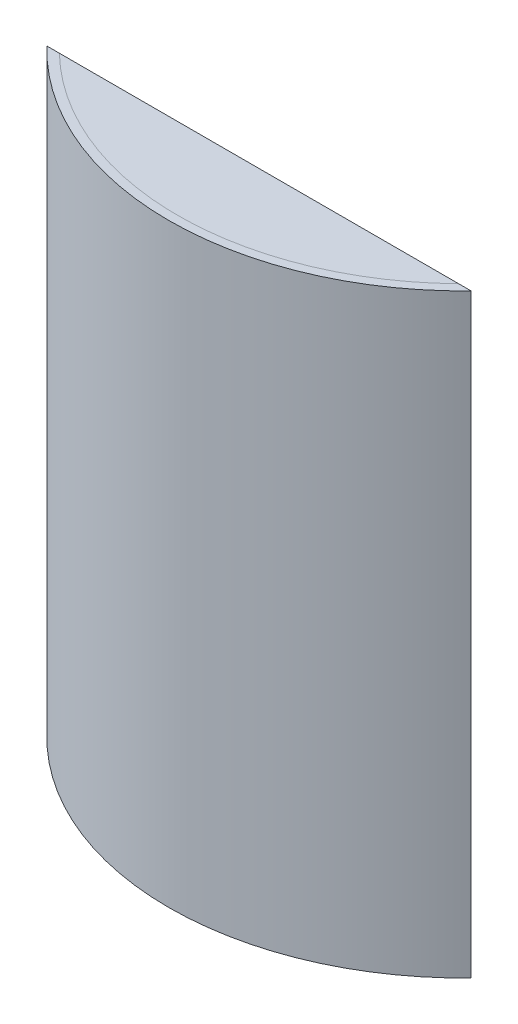
ISO-10303-21;
HEADER;
FILE_DESCRIPTION(('STEP AP214'),'2;1');
FILE_NAME('part.step','',(''),(''),'','','');
FILE_SCHEMA(('AUTOMOTIVE_DESIGN { 1 0 10303 214 1 1 1 1 }'));
ENDSEC;
DATA;
#1=APPLICATION_CONTEXT('core data for automotive mechanical design processes');
#2=APPLICATION_PROTOCOL_DEFINITION('international standard','automotive_design',2000,#1);
#3=PRODUCT_CONTEXT('',#1,'mechanical');
#4=PRODUCT('Part','Part','',(#3));
#5=PRODUCT_RELATED_PRODUCT_CATEGORY('part','',(#4));
#6=PRODUCT_DEFINITION_FORMATION('','',#4);
#7=PRODUCT_DEFINITION_CONTEXT('part definition',#1,'design');
#8=PRODUCT_DEFINITION('design','',#6,#7);
#9=PRODUCT_DEFINITION_SHAPE('','',#8);
#10=(LENGTH_UNIT() NAMED_UNIT(*) SI_UNIT(.MILLI.,.METRE.));
#11=(NAMED_UNIT(*) PLANE_ANGLE_UNIT() SI_UNIT($,.RADIAN.));
#12=(NAMED_UNIT(*) SI_UNIT($,.STERADIAN.) SOLID_ANGLE_UNIT());
#13=UNCERTAINTY_MEASURE_WITH_UNIT(LENGTH_MEASURE(1.E-05),#10,'distance_accuracy_value','');
#14=(GEOMETRIC_REPRESENTATION_CONTEXT(3) GLOBAL_UNCERTAINTY_ASSIGNED_CONTEXT((#13)) GLOBAL_UNIT_ASSIGNED_CONTEXT((#10,
#11,#12)) REPRESENTATION_CONTEXT('',''));
#15=CARTESIAN_POINT('',(0.,0.,0.));
#16=DIRECTION('',(0.,0.,1.));
#17=DIRECTION('',(1.,0.,0.));
#18=AXIS2_PLACEMENT_3D('',#15,#16,#17);
#19=CARTESIAN_POINT('',(0.,200.,0.));
#20=DIRECTION('',(0.,1.,0.));
#21=DIRECTION('',(0.,0.,1.));
#22=AXIS2_PLACEMENT_3D('',#19,#20,#21);
#23=CYLINDRICAL_SURFACE('',#22,97.);
#24=CARTESIAN_POINT('',(0.,202.,0.));
#25=DIRECTION('',(0.,1.,0.));
#26=DIRECTION('',(0.,0.,1.));
#27=AXIS2_PLACEMENT_3D('',#24,#25,#26);
#28=CIRCLE('',#27,97.);
#29=CARTESIAN_POINT('',(67.7716754994297,202.,69.3974062915899));
#30=VERTEX_POINT('',#29);
#31=CARTESIAN_POINT('',(-67.7716754994297,202.,69.3974062915899));
#32=VERTEX_POINT('',#31);
#33=EDGE_CURVE('E82',#30,#32,#28,.F.);
#34=ORIENTED_EDGE('',*,*,#33,.T.);
#35=DIRECTION('',(0.,1.,0.));
#36=VECTOR('',#35,1.);
#37=CARTESIAN_POINT('',(-67.7716754994297,200.,69.3974062915899));
#38=LINE('',#37,#36);
#39=CARTESIAN_POINT('',(-67.7716754994297,200.,69.3974062915899));
#40=VERTEX_POINT('',#39);
#41=EDGE_CURVE('E12',#40,#32,#38,.T.);
#42=ORIENTED_EDGE('',*,*,#41,.F.);
#43=CARTESIAN_POINT('',(0.,200.,0.));
#44=DIRECTION('',(0.,1.,0.));
#45=DIRECTION('',(0.,0.,1.));
#46=AXIS2_PLACEMENT_3D('',#43,#44,#45);
#47=CIRCLE('',#46,97.);
#48=CARTESIAN_POINT('',(67.7716754994297,200.,69.3974062915899));
#49=VERTEX_POINT('',#48);
#50=EDGE_CURVE('E66',#49,#40,#47,.F.);
#51=ORIENTED_EDGE('',*,*,#50,.F.);
#52=DIRECTION('',(0.,1.,0.));
#53=VECTOR('',#52,1.);
#54=CARTESIAN_POINT('',(67.7716754994297,200.,69.3974062915899));
#55=LINE('',#54,#53);
#56=EDGE_CURVE('E54',#49,#30,#55,.T.);
#57=ORIENTED_EDGE('',*,*,#56,.T.);
#58=EDGE_LOOP('',(#34,#42,#51,#57));
#59=FACE_BOUND('',#58,.T.);
#60=ADVANCED_FACE('F51',(#59),#23,.T.);
#61=CARTESIAN_POINT('',(0.,200.,69.3974062915899));
#62=DIRECTION('',(0.,0.,-1.));
#63=DIRECTION('',(-1.,0.,0.));
#64=AXIS2_PLACEMENT_3D('',#61,#62,#63);
#65=PLANE('',#64);
#66=DIRECTION('',(-1.,0.,0.));
#67=VECTOR('',#66,1.);
#68=CARTESIAN_POINT('',(0.,202.,69.3974062915899));
#69=LINE('',#68,#67);
#70=EDGE_CURVE('E80',#30,#32,#69,.T.);
#71=ORIENTED_EDGE('',*,*,#70,.F.);
#72=ORIENTED_EDGE('',*,*,#56,.F.);
#73=DIRECTION('',(-1.,0.,0.));
#74=VECTOR('',#73,1.);
#75=CARTESIAN_POINT('',(0.,200.,69.3974062915899));
#76=LINE('',#75,#74);
#77=EDGE_CURVE('E81',#49,#40,#76,.T.);
#78=ORIENTED_EDGE('',*,*,#77,.T.);
#79=ORIENTED_EDGE('',*,*,#41,.T.);
#80=EDGE_LOOP('',(#71,#72,#78,#79));
#81=FACE_BOUND('',#80,.T.);
#82=ADVANCED_FACE('F78',(#81),#65,.T.);
#83=CARTESIAN_POINT('',(0.,200.,0.));
#84=DIRECTION('',(0.,1.,0.));
#85=DIRECTION('',(0.,0.,1.));
#86=AXIS2_PLACEMENT_3D('',#83,#84,#85);
#87=PLANE('',#86);
#88=ORIENTED_EDGE('',*,*,#50,.T.);
#89=ORIENTED_EDGE('',*,*,#77,.F.);
#90=EDGE_LOOP('',(#88,#89));
#91=FACE_BOUND('',#90,.T.);
#92=ADVANCED_FACE('F90',(#91),#87,.F.);
#93=CARTESIAN_POINT('',(0.,202.,0.));
#94=DIRECTION('',(0.,1.,0.));
#95=DIRECTION('',(0.,0.,1.));
#96=AXIS2_PLACEMENT_3D('',#93,#94,#95);
#97=PLANE('',#96);
#98=ORIENTED_EDGE('',*,*,#33,.F.);
#99=ORIENTED_EDGE('',*,*,#70,.T.);
#100=EDGE_LOOP('',(#98,#99));
#101=FACE_BOUND('',#100,.T.);
#102=ADVANCED_FACE('F85',(#101),#97,.T.);
#103=CLOSED_SHELL('',(#60,#82,#92,#102));
#104=MANIFOLD_SOLID_BREP('B2',#103);
#105=CARTESIAN_POINT('',(0.,202.,0.));
#106=DIRECTION('',(0.,-1.,0.));
#107=DIRECTION('',(0.,0.,-1.));
#108=AXIS2_PLACEMENT_3D('',#105,#106,#107);
#109=CYLINDRICAL_SURFACE('',#108,97.);
#110=CARTESIAN_POINT('',(0.,2.,0.));
#111=DIRECTION('',(0.,1.,0.));
#112=DIRECTION('',(0.,0.,1.));
#113=AXIS2_PLACEMENT_3D('',#110,#111,#112);
#114=CIRCLE('',#113,97.);
#115=CARTESIAN_POINT('',(-67.7716754994297,2.,69.3974062915899));
#116=VERTEX_POINT('',#115);
#117=CARTESIAN_POINT('',(67.7716754994297,2.,69.3974062915899));
#118=VERTEX_POINT('',#117);
#119=EDGE_CURVE('E162',#116,#118,#114,.T.);
#120=ORIENTED_EDGE('',*,*,#119,.F.);
#121=DIRECTION('',(0.,-1.,0.));
#122=VECTOR('',#121,1.);
#123=CARTESIAN_POINT('',(-67.7716754994297,202.,69.3974062915899));
#124=LINE('',#123,#122);
#125=CARTESIAN_POINT('',(-67.7716754994297,202.,69.3974062915899));
#126=VERTEX_POINT('',#125);
#127=EDGE_CURVE('E49',#126,#116,#124,.T.);
#128=ORIENTED_EDGE('',*,*,#127,.F.);
#129=CARTESIAN_POINT('',(0.,202.,0.));
#130=DIRECTION('',(0.,1.,0.));
#131=DIRECTION('',(0.,0.,1.));
#132=AXIS2_PLACEMENT_3D('',#129,#130,#131);
#133=CIRCLE('',#132,97.);
#134=CARTESIAN_POINT('',(67.7716754994297,202.,69.3974062915899));
#135=VERTEX_POINT('',#134);
#136=EDGE_CURVE('E185',#126,#135,#133,.T.);
#137=ORIENTED_EDGE('',*,*,#136,.T.);
#138=DIRECTION('',(0.,-1.,0.));
#139=VECTOR('',#138,1.);
#140=CARTESIAN_POINT('',(67.7716754994297,202.,69.3974062915899));
#141=LINE('',#140,#139);
#142=EDGE_CURVE('E140',#135,#118,#141,.T.);
#143=ORIENTED_EDGE('',*,*,#142,.T.);
#144=EDGE_LOOP('',(#120,#128,#137,#143));
#145=FACE_BOUND('',#144,.T.);
#146=ADVANCED_FACE('F123',(#145),#109,.F.);
#147=CARTESIAN_POINT('',(0.,202.,0.));
#148=DIRECTION('',(0.,-1.,0.));
#149=DIRECTION('',(0.,0.,-1.));
#150=AXIS2_PLACEMENT_3D('',#147,#148,#149);
#151=CYLINDRICAL_SURFACE('',#150,100.);
#152=DIRECTION('',(0.,-1.,0.));
#153=VECTOR('',#152,1.);
#154=CARTESIAN_POINT('',(-72.,202.,69.3974062915899));
#155=LINE('',#154,#153);
#156=CARTESIAN_POINT('',(-72.,202.,69.3974062915899));
#157=VERTEX_POINT('',#156);
#158=CARTESIAN_POINT('',(-72.,0.,69.3974062915899));
#159=VERTEX_POINT('',#158);
#160=EDGE_CURVE('E132',#157,#159,#155,.T.);
#161=ORIENTED_EDGE('',*,*,#160,.T.);
#162=CARTESIAN_POINT('',(0.,0.,0.));
#163=DIRECTION('',(0.,1.,0.));
#164=DIRECTION('',(0.,0.,1.));
#165=AXIS2_PLACEMENT_3D('',#162,#163,#164);
#166=CIRCLE('',#165,100.);
#167=CARTESIAN_POINT('',(72.,0.,69.3974062915899));
#168=VERTEX_POINT('',#167);
#169=EDGE_CURVE('E197',#159,#168,#166,.T.);
#170=ORIENTED_EDGE('',*,*,#169,.T.);
#171=DIRECTION('',(0.,-1.,0.));
#172=VECTOR('',#171,1.);
#173=CARTESIAN_POINT('',(72.,202.,69.3974062915899));
#174=LINE('',#173,#172);
#175=CARTESIAN_POINT('',(72.,202.,69.3974062915899));
#176=VERTEX_POINT('',#175);
#177=EDGE_CURVE('E174',#176,#168,#174,.T.);
#178=ORIENTED_EDGE('',*,*,#177,.F.);
#179=CARTESIAN_POINT('',(0.,202.,0.));
#180=DIRECTION('',(0.,1.,0.));
#181=DIRECTION('',(0.,0.,1.));
#182=AXIS2_PLACEMENT_3D('',#179,#180,#181);
#183=CIRCLE('',#182,100.);
#184=EDGE_CURVE('E176',#157,#176,#183,.T.);
#185=ORIENTED_EDGE('',*,*,#184,.F.);
#186=EDGE_LOOP('',(#161,#170,#178,#185));
#187=FACE_BOUND('',#186,.T.);
#188=ADVANCED_FACE('F177',(#187),#151,.T.);
#189=CARTESIAN_POINT('',(0.,202.,69.3974062915899));
#190=DIRECTION('',(0.,0.,-1.));
#191=DIRECTION('',(-1.,0.,0.));
#192=AXIS2_PLACEMENT_3D('',#189,#190,#191);
#193=PLANE('',#192);
#194=ORIENTED_EDGE('',*,*,#177,.T.);
#195=DIRECTION('',(1.,0.,0.));
#196=VECTOR('',#195,1.);
#197=CARTESIAN_POINT('',(0.,0.,69.3974062915899));
#198=LINE('',#197,#196);
#199=EDGE_CURVE('E171',#159,#168,#198,.T.);
#200=ORIENTED_EDGE('',*,*,#199,.F.);
#201=ORIENTED_EDGE('',*,*,#160,.F.);
#202=DIRECTION('',(1.,0.,0.));
#203=VECTOR('',#202,1.);
#204=CARTESIAN_POINT('',(0.,202.,69.3974062915899));
#205=LINE('',#204,#203);
#206=EDGE_CURVE('E169',#157,#126,#205,.T.);
#207=ORIENTED_EDGE('',*,*,#206,.T.);
#208=ORIENTED_EDGE('',*,*,#127,.T.);
#209=DIRECTION('',(1.,0.,0.));
#210=VECTOR('',#209,1.);
#211=CARTESIAN_POINT('',(-72.,2.,69.3974062915899));
#212=LINE('',#211,#210);
#213=EDGE_CURVE('E218',#116,#118,#212,.T.);
#214=ORIENTED_EDGE('',*,*,#213,.T.);
#215=ORIENTED_EDGE('',*,*,#142,.F.);
#216=EDGE_CURVE('E181',#135,#176,#205,.T.);
#217=ORIENTED_EDGE('',*,*,#216,.T.);
#218=EDGE_LOOP('',(#194,#200,#201,#207,#208,#214,#215,#217));
#219=FACE_BOUND('',#218,.T.);
#220=ADVANCED_FACE('F167',(#219),#193,.T.);
#221=CARTESIAN_POINT('',(0.,202.,0.));
#222=DIRECTION('',(0.,1.,0.));
#223=DIRECTION('',(0.,0.,1.));
#224=AXIS2_PLACEMENT_3D('',#221,#222,#223);
#225=PLANE('',#224);
#226=ORIENTED_EDGE('',*,*,#136,.F.);
#227=ORIENTED_EDGE('',*,*,#206,.F.);
#228=ORIENTED_EDGE('',*,*,#184,.T.);
#229=ORIENTED_EDGE('',*,*,#216,.F.);
#230=EDGE_LOOP('',(#226,#227,#228,#229));
#231=FACE_BOUND('',#230,.T.);
#232=ADVANCED_FACE('F184',(#231),#225,.T.);
#233=CARTESIAN_POINT('',(0.,0.,0.));
#234=DIRECTION('',(0.,1.,0.));
#235=DIRECTION('',(0.,0.,1.));
#236=AXIS2_PLACEMENT_3D('',#233,#234,#235);
#237=PLANE('',#236);
#238=ORIENTED_EDGE('',*,*,#169,.F.);
#239=ORIENTED_EDGE('',*,*,#199,.T.);
#240=EDGE_LOOP('',(#238,#239));
#241=FACE_BOUND('',#240,.T.);
#242=ADVANCED_FACE('F202',(#241),#237,.F.);
#243=CARTESIAN_POINT('',(0.,2.,0.));
#244=DIRECTION('',(0.,1.,0.));
#245=DIRECTION('',(0.,0.,1.));
#246=AXIS2_PLACEMENT_3D('',#243,#244,#245);
#247=PLANE('',#246);
#248=ORIENTED_EDGE('',*,*,#213,.F.);
#249=ORIENTED_EDGE('',*,*,#119,.T.);
#250=EDGE_LOOP('',(#248,#249));
#251=FACE_BOUND('',#250,.T.);
#252=ADVANCED_FACE('F204',(#251),#247,.T.);
#253=CLOSED_SHELL('',(#146,#188,#220,#232,#242,#252));
#254=MANIFOLD_SOLID_BREP('B6',#253);
#255=ADVANCED_BREP_SHAPE_REPRESENTATION('',(#18,#104,#254),#14);
#256=SHAPE_DEFINITION_REPRESENTATION(#9,#255);
ENDSEC;
END-ISO-10303-21;
